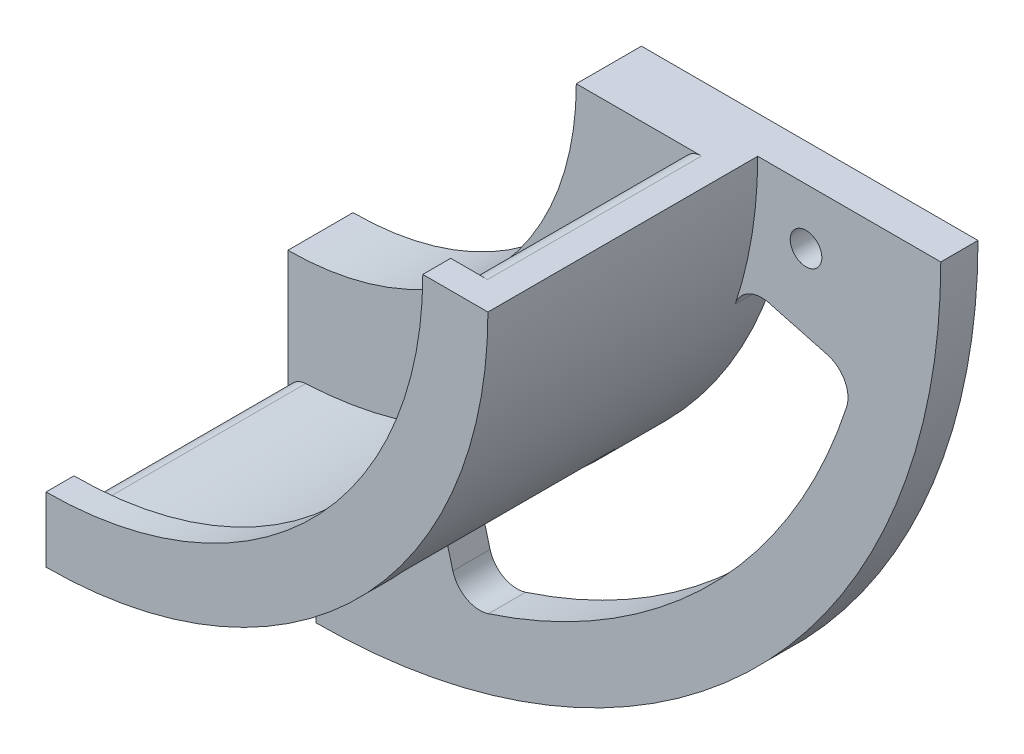
ISO-10303-21;
HEADER;
FILE_DESCRIPTION(('STEP AP214'),'2;1');
FILE_NAME('part.step','',(''),(''),'','','');
FILE_SCHEMA(('AUTOMOTIVE_DESIGN { 1 0 10303 214 1 1 1 1 }'));
ENDSEC;
DATA;
#1=APPLICATION_CONTEXT('core data for automotive mechanical design processes');
#2=APPLICATION_PROTOCOL_DEFINITION('international standard','automotive_design',2000,#1);
#3=PRODUCT_CONTEXT('',#1,'mechanical');
#4=PRODUCT('Part','Part','',(#3));
#5=PRODUCT_RELATED_PRODUCT_CATEGORY('part','',(#4));
#6=PRODUCT_DEFINITION_FORMATION('','',#4);
#7=PRODUCT_DEFINITION_CONTEXT('part definition',#1,'design');
#8=PRODUCT_DEFINITION('design','',#6,#7);
#9=PRODUCT_DEFINITION_SHAPE('','',#8);
#10=(LENGTH_UNIT() NAMED_UNIT(*) SI_UNIT(.MILLI.,.METRE.));
#11=(NAMED_UNIT(*) PLANE_ANGLE_UNIT() SI_UNIT($,.RADIAN.));
#12=(NAMED_UNIT(*) SI_UNIT($,.STERADIAN.) SOLID_ANGLE_UNIT());
#13=UNCERTAINTY_MEASURE_WITH_UNIT(LENGTH_MEASURE(1.E-05),#10,'distance_accuracy_value','');
#14=(GEOMETRIC_REPRESENTATION_CONTEXT(3) GLOBAL_UNCERTAINTY_ASSIGNED_CONTEXT((#13)) GLOBAL_UNIT_ASSIGNED_CONTEXT((#10,
#11,#12)) REPRESENTATION_CONTEXT('',''));
#15=CARTESIAN_POINT('',(0.,0.,0.));
#16=DIRECTION('',(0.,0.,1.));
#17=DIRECTION('',(1.,0.,0.));
#18=AXIS2_PLACEMENT_3D('',#15,#16,#17);
#19=CARTESIAN_POINT('',(-16.6800009459903,-6.49744222896134,3.));
#20=DIRECTION('',(0.,0.,1.));
#21=DIRECTION('',(1.,0.,0.));
#22=AXIS2_PLACEMENT_3D('',#19,#20,#21);
#23=PLANE('',#22);
#24=DIRECTION('',(0.,-1.,0.));
#25=VECTOR('',#24,1.);
#26=CARTESIAN_POINT('',(-16.6800009459903,-37.4974422289613,3.));
#27=LINE('',#26,#25);
#28=CARTESIAN_POINT('',(-16.6800009459903,-37.4974422289613,3.));
#29=VERTEX_POINT('',#28);
#30=CARTESIAN_POINT('',(-16.6800009459903,-50.9524756897518,3.));
#31=VERTEX_POINT('',#30);
#32=EDGE_CURVE('E303',#29,#31,#27,.T.);
#33=ORIENTED_EDGE('',*,*,#32,.T.);
#34=CARTESIAN_POINT('',(-14.6800009459903,-50.9524756897518,3.));
#35=DIRECTION('',(0.,0.,1.));
#36=DIRECTION('',(1.,0.,0.));
#37=AXIS2_PLACEMENT_3D('',#34,#35,#36);
#38=CIRCLE('',#37,2.);
#39=CARTESIAN_POINT('',(-14.7698885864398,-48.9544966578062,3.));
#40=VERTEX_POINT('',#39);
#41=EDGE_CURVE('E339',#31,#40,#38,.F.);
#42=ORIENTED_EDGE('',*,*,#41,.T.);
#43=CARTESIAN_POINT('',(-16.6800009459903,-6.49744222896134,3.));
#44=DIRECTION('',(0.,0.,-1.));
#45=DIRECTION('',(1.,0.,0.));
#46=AXIS2_PLACEMENT_3D('',#43,#44,#45);
#47=CIRCLE('',#46,42.5);
#48=CARTESIAN_POINT('',(10.1790164632336,-39.4343999483835,3.));
#49=VERTEX_POINT('',#48);
#50=EDGE_CURVE('E269',#49,#40,#47,.T.);
#51=ORIENTED_EDGE('',*,*,#50,.F.);
#52=CARTESIAN_POINT('',(11.4429702236677,-40.9843744292975,3.));
#53=DIRECTION('',(0.,0.,1.));
#54=DIRECTION('',(1.,0.,0.));
#55=AXIS2_PLACEMENT_3D('',#52,#53,#54);
#56=CIRCLE('',#55,2.);
#57=CARTESIAN_POINT('',(12.8571837860408,-39.5701608669244,3.));
#58=VERTEX_POINT('',#57);
#59=EDGE_CURVE('E344',#49,#58,#56,.F.);
#60=ORIENTED_EDGE('',*,*,#59,.T.);
#61=DIRECTION('',(-0.707106781186556,0.707106781186539,0.));
#62=VECTOR('',#61,1.);
#63=CARTESIAN_POINT('',(11.5522321010437,-38.2652091819274,3.));
#64=LINE('',#63,#62);
#65=CARTESIAN_POINT('',(15.0932517635406,-41.8062288444242,3.));
#66=VERTEX_POINT('',#65);
#67=EDGE_CURVE('E274',#66,#58,#64,.T.);
#68=ORIENTED_EDGE('',*,*,#67,.F.);
#69=CARTESIAN_POINT('',(-16.6800009459903,-6.49744222896134,3.));
#70=DIRECTION('',(0.,0.,1.));
#71=DIRECTION('',(1.,0.,0.));
#72=AXIS2_PLACEMENT_3D('',#69,#70,#71);
#73=CIRCLE('',#72,47.5);
#74=CARTESIAN_POINT('',(18.6287856694733,-38.2706949384914,3.));
#75=VERTEX_POINT('',#74);
#76=EDGE_CURVE('E296',#66,#75,#73,.T.);
#77=ORIENTED_EDGE('',*,*,#76,.T.);
#78=DIRECTION('',(0.707106781186557,-0.707106781186538,0.));
#79=VECTOR('',#78,1.);
#80=CARTESIAN_POINT('',(15.0877660069764,-34.7296752759946,3.));
#81=LINE('',#80,#79);
#82=CARTESIAN_POINT('',(16.3927176919735,-36.0346269609916,3.));
#83=VERTEX_POINT('',#82);
#84=EDGE_CURVE('E288',#83,#75,#81,.T.);
#85=ORIENTED_EDGE('',*,*,#84,.F.);
#86=CARTESIAN_POINT('',(17.8069312543466,-34.6204133986185,3.));
#87=DIRECTION('',(0.,0.,1.));
#88=DIRECTION('',(1.,0.,0.));
#89=AXIS2_PLACEMENT_3D('',#86,#87,#88);
#90=CIRCLE('',#89,2.);
#91=CARTESIAN_POINT('',(16.2569567734325,-33.3564596381845,3.));
#92=VERTEX_POINT('',#91);
#93=EDGE_CURVE('E348',#83,#92,#90,.F.);
#94=ORIENTED_EDGE('',*,*,#93,.T.);
#95=CARTESIAN_POINT('',(-16.6800009459903,-6.49744222896134,3.));
#96=DIRECTION('',(0.,0.,-1.));
#97=DIRECTION('',(1.,0.,0.));
#98=AXIS2_PLACEMENT_3D('',#95,#96,#97);
#99=CIRCLE('',#98,42.5);
#100=CARTESIAN_POINT('',(25.7770534828545,-8.4075545885119,3.));
#101=VERTEX_POINT('',#100);
#102=EDGE_CURVE('E283',#101,#92,#99,.T.);
#103=ORIENTED_EDGE('',*,*,#102,.F.);
#104=CARTESIAN_POINT('',(27.7750325148001,-8.49744222896134,3.));
#105=DIRECTION('',(0.,0.,1.));
#106=DIRECTION('',(1.,0.,0.));
#107=AXIS2_PLACEMENT_3D('',#104,#105,#106);
#108=CIRCLE('',#107,2.);
#109=CARTESIAN_POINT('',(27.7750325148001,-6.49744222896134,3.));
#110=VERTEX_POINT('',#109);
#111=EDGE_CURVE('E334',#101,#110,#108,.F.);
#112=ORIENTED_EDGE('',*,*,#111,.T.);
#113=DIRECTION('',(-1.,0.,0.));
#114=VECTOR('',#113,1.);
#115=CARTESIAN_POINT('',(14.3199990540097,-6.49744222896134,3.));
#116=LINE('',#115,#114);
#117=CARTESIAN_POINT('',(14.3199990540097,-6.49744222896134,3.));
#118=VERTEX_POINT('',#117);
#119=EDGE_CURVE('E299',#110,#118,#116,.T.);
#120=ORIENTED_EDGE('',*,*,#119,.T.);
#121=CARTESIAN_POINT('',(-16.6800009459903,-6.49744222896134,3.));
#122=DIRECTION('',(0.,0.,-1.));
#123=DIRECTION('',(1.,0.,0.));
#124=AXIS2_PLACEMENT_3D('',#121,#122,#123);
#125=CIRCLE('',#124,31.);
#126=EDGE_CURVE('E301',#118,#29,#125,.T.);
#127=ORIENTED_EDGE('',*,*,#126,.T.);
#128=EDGE_LOOP('',(#33,#42,#51,#60,#68,#77,#85,#94,#103,#112,#120,#127));
#129=FACE_BOUND('',#128,.T.);
#130=ADVANCED_FACE('F35',(#129),#23,.T.);
#131=CARTESIAN_POINT('',(-16.6800009459903,-6.49744222896134,3.));
#132=DIRECTION('',(0.,0.,-1.));
#133=DIRECTION('',(-1.,0.,0.));
#134=AXIS2_PLACEMENT_3D('',#131,#132,#133);
#135=CYLINDRICAL_SURFACE('',#134,47.5);
#136=CARTESIAN_POINT('',(-16.6800009459903,-6.49744222896134,0.));
#137=DIRECTION('',(0.,0.,1.));
#138=DIRECTION('',(1.,0.,0.));
#139=AXIS2_PLACEMENT_3D('',#136,#137,#138);
#140=CIRCLE('',#139,47.5);
#141=CARTESIAN_POINT('',(-16.6800009459905,-53.9974422289613,0.));
#142=VERTEX_POINT('',#141);
#143=CARTESIAN_POINT('',(-1.68217619344417,-51.5675570800677,0.));
#144=VERTEX_POINT('',#143);
#145=EDGE_CURVE('E50',#142,#144,#140,.T.);
#146=ORIENTED_EDGE('',*,*,#145,.T.);
#147=DIRECTION('',(0.,0.,-1.));
#148=VECTOR('',#147,1.);
#149=CARTESIAN_POINT('',(-1.68217619344417,-51.5675570800677,3.));
#150=LINE('',#149,#148);
#151=CARTESIAN_POINT('',(-1.68217619344416,-51.5675570800677,-4.));
#152=VERTEX_POINT('',#151);
#153=EDGE_CURVE('E370',#144,#152,#150,.T.);
#154=ORIENTED_EDGE('',*,*,#153,.T.);
#155=CARTESIAN_POINT('',(-16.6800009459903,-6.49744222896134,-4.));
#156=DIRECTION('',(0.,0.,1.));
#157=DIRECTION('',(-1.,0.,0.));
#158=AXIS2_PLACEMENT_3D('',#155,#156,#157);
#159=CIRCLE('',#158,47.5);
#160=CARTESIAN_POINT('',(28.3901139051159,-21.4952669815078,-4.));
#161=VERTEX_POINT('',#160);
#162=EDGE_CURVE('E403',#152,#161,#159,.T.);
#163=ORIENTED_EDGE('',*,*,#162,.T.);
#164=DIRECTION('',(0.,0.,-1.));
#165=VECTOR('',#164,1.);
#166=CARTESIAN_POINT('',(28.3901139051159,-21.4952669815078,3.));
#167=LINE('',#166,#165);
#168=CARTESIAN_POINT('',(28.3901139051159,-21.4952669815078,0.));
#169=VERTEX_POINT('',#168);
#170=EDGE_CURVE('E367',#161,#169,#167,.F.);
#171=ORIENTED_EDGE('',*,*,#170,.T.);
#172=CARTESIAN_POINT('',(30.8199990540097,-6.49744222896134,0.));
#173=VERTEX_POINT('',#172);
#174=EDGE_CURVE('E58',#169,#173,#140,.T.);
#175=ORIENTED_EDGE('',*,*,#174,.T.);
#176=DIRECTION('',(0.,0.,-1.));
#177=VECTOR('',#176,1.);
#178=CARTESIAN_POINT('',(30.8199990540097,-6.49744222896134,3.));
#179=LINE('',#178,#177);
#180=CARTESIAN_POINT('',(30.8199990540097,-6.49744222896134,29.));
#181=VERTEX_POINT('',#180);
#182=EDGE_CURVE('E311',#181,#173,#179,.T.);
#183=ORIENTED_EDGE('',*,*,#182,.F.);
#184=CARTESIAN_POINT('',(-16.6800009459903,-6.49744222896134,29.));
#185=DIRECTION('',(0.,0.,1.));
#186=DIRECTION('',(1.,0.,0.));
#187=AXIS2_PLACEMENT_3D('',#184,#185,#186);
#188=CIRCLE('',#187,47.5);
#189=CARTESIAN_POINT('',(-16.6800009459903,-53.9974422289613,29.));
#190=VERTEX_POINT('',#189);
#191=EDGE_CURVE('E253',#190,#181,#188,.T.);
#192=ORIENTED_EDGE('',*,*,#191,.F.);
#193=DIRECTION('',(0.,0.,-1.));
#194=VECTOR('',#193,1.);
#195=CARTESIAN_POINT('',(-16.6800009459903,-53.9974422289613,3.));
#196=LINE('',#195,#194);
#197=EDGE_CURVE('E305',#190,#142,#196,.T.);
#198=ORIENTED_EDGE('',*,*,#197,.T.);
#199=EDGE_LOOP('',(#146,#154,#163,#171,#175,#183,#192,#198));
#200=FACE_BOUND('',#199,.T.);
#201=CARTESIAN_POINT('',(-16.6800009459903,-6.49744222896134,26.));
#202=DIRECTION('',(0.,0.,1.));
#203=DIRECTION('',(1.,0.,0.));
#204=AXIS2_PLACEMENT_3D('',#201,#202,#203);
#205=CIRCLE('',#204,47.5);
#206=CARTESIAN_POINT('',(15.0932517635406,-41.8062288444242,26.));
#207=VERTEX_POINT('',#206);
#208=CARTESIAN_POINT('',(18.6287856694733,-38.2706949384914,26.));
#209=VERTEX_POINT('',#208);
#210=EDGE_CURVE('E260',#207,#209,#205,.T.);
#211=ORIENTED_EDGE('',*,*,#210,.T.);
#212=DIRECTION('',(0.,0.,-1.));
#213=VECTOR('',#212,1.);
#214=CARTESIAN_POINT('',(18.6287856694733,-38.2706949384914,26.));
#215=LINE('',#214,#213);
#216=EDGE_CURVE('E290',#209,#75,#215,.T.);
#217=ORIENTED_EDGE('',*,*,#216,.T.);
#218=ORIENTED_EDGE('',*,*,#76,.F.);
#219=DIRECTION('',(0.,0.,-1.));
#220=VECTOR('',#219,1.);
#221=CARTESIAN_POINT('',(15.0932517635406,-41.8062288444242,26.));
#222=LINE('',#221,#220);
#223=EDGE_CURVE('E277',#207,#66,#222,.T.);
#224=ORIENTED_EDGE('',*,*,#223,.F.);
#225=EDGE_LOOP('',(#211,#217,#218,#224));
#226=FACE_BOUND('',#225,.T.);
#227=ADVANCED_FACE('F406',(#200,#226),#135,.T.);
#228=CARTESIAN_POINT('',(14.3199990540097,-6.49744222896134,3.));
#229=DIRECTION('',(0.,-1.,0.));
#230=DIRECTION('',(0.,0.,-1.));
#231=AXIS2_PLACEMENT_3D('',#228,#229,#230);
#232=PLANE('',#231);
#233=ORIENTED_EDGE('',*,*,#119,.F.);
#234=DIRECTION('',(0.,0.,-1.));
#235=VECTOR('',#234,1.);
#236=CARTESIAN_POINT('',(27.7750325148001,-6.49744222896134,3.));
#237=LINE('',#236,#235);
#238=CARTESIAN_POINT('',(27.7750325148001,-6.49744222896134,26.));
#239=VERTEX_POINT('',#238);
#240=EDGE_CURVE('E319',#110,#239,#237,.F.);
#241=ORIENTED_EDGE('',*,*,#240,.T.);
#242=DIRECTION('',(-1.,0.,0.));
#243=VECTOR('',#242,1.);
#244=CARTESIAN_POINT('',(23.8199990540097,-6.49744222896134,26.));
#245=LINE('',#244,#243);
#246=CARTESIAN_POINT('',(23.8199990540097,-6.49744222896134,26.));
#247=VERTEX_POINT('',#246);
#248=EDGE_CURVE('E250',#239,#247,#245,.T.);
#249=ORIENTED_EDGE('',*,*,#248,.T.);
#250=DIRECTION('',(0.,0.,-1.));
#251=VECTOR('',#250,1.);
#252=CARTESIAN_POINT('',(23.8199990540097,-6.49744222896134,29.));
#253=LINE('',#252,#251);
#254=CARTESIAN_POINT('',(23.8199990540097,-6.49744222896134,29.));
#255=VERTEX_POINT('',#254);
#256=EDGE_CURVE('E257',#255,#247,#253,.T.);
#257=ORIENTED_EDGE('',*,*,#256,.F.);
#258=DIRECTION('',(-1.,0.,0.));
#259=VECTOR('',#258,1.);
#260=CARTESIAN_POINT('',(23.8199990540097,-6.49744222896134,29.));
#261=LINE('',#260,#259);
#262=EDGE_CURVE('E256',#181,#255,#261,.T.);
#263=ORIENTED_EDGE('',*,*,#262,.F.);
#264=ORIENTED_EDGE('',*,*,#182,.T.);
#265=DIRECTION('',(1.,0.,0.));
#266=VECTOR('',#265,1.);
#267=CARTESIAN_POINT('',(50.4951432667317,-6.49744222896134,0.));
#268=LINE('',#267,#266);
#269=CARTESIAN_POINT('',(50.4951432667317,-6.49744222896134,0.));
#270=VERTEX_POINT('',#269);
#271=EDGE_CURVE('E232',#173,#270,#268,.T.);
#272=ORIENTED_EDGE('',*,*,#271,.T.);
#273=DIRECTION('',(0.,0.,1.));
#274=VECTOR('',#273,1.);
#275=CARTESIAN_POINT('',(50.4951432667317,-6.49744222896134,-4.));
#276=LINE('',#275,#274);
#277=CARTESIAN_POINT('',(50.4951432667317,-6.49744222896134,-4.));
#278=VERTEX_POINT('',#277);
#279=EDGE_CURVE('E238',#278,#270,#276,.T.);
#280=ORIENTED_EDGE('',*,*,#279,.F.);
#281=DIRECTION('',(1.,0.,0.));
#282=VECTOR('',#281,1.);
#283=CARTESIAN_POINT('',(50.4951432667317,-6.49744222896134,-4.));
#284=LINE('',#283,#282);
#285=CARTESIAN_POINT('',(14.3199990540097,-6.49744222896134,-4.));
#286=VERTEX_POINT('',#285);
#287=EDGE_CURVE('E228',#286,#278,#284,.T.);
#288=ORIENTED_EDGE('',*,*,#287,.F.);
#289=DIRECTION('',(0.,0.,-1.));
#290=VECTOR('',#289,1.);
#291=CARTESIAN_POINT('',(14.3199990540097,-6.49744222896134,3.));
#292=LINE('',#291,#290);
#293=EDGE_CURVE('E309',#118,#286,#292,.T.);
#294=ORIENTED_EDGE('',*,*,#293,.F.);
#295=EDGE_LOOP('',(#233,#241,#249,#257,#263,#264,#272,#280,#288,#294));
#296=FACE_BOUND('',#295,.T.);
#297=ADVANCED_FACE('F431',(#296),#232,.F.);
#298=CARTESIAN_POINT('',(-16.6800009459903,-6.49744222896134,3.));
#299=DIRECTION('',(0.,0.,-1.));
#300=DIRECTION('',(-1.,0.,0.));
#301=AXIS2_PLACEMENT_3D('',#298,#299,#300);
#302=CYLINDRICAL_SURFACE('',#301,31.);
#303=ORIENTED_EDGE('',*,*,#293,.T.);
#304=CARTESIAN_POINT('',(-16.6800009459903,-6.49744222896134,-4.));
#305=DIRECTION('',(0.,0.,1.));
#306=DIRECTION('',(-1.,0.,0.));
#307=AXIS2_PLACEMENT_3D('',#304,#305,#306);
#308=CIRCLE('',#307,31.);
#309=CARTESIAN_POINT('',(-16.6800009459905,-37.4974422289613,-4.));
#310=VERTEX_POINT('',#309);
#311=EDGE_CURVE('E221',#310,#286,#308,.T.);
#312=ORIENTED_EDGE('',*,*,#311,.F.);
#313=DIRECTION('',(0.,0.,-1.));
#314=VECTOR('',#313,1.);
#315=CARTESIAN_POINT('',(-16.6800009459903,-37.4974422289613,3.));
#316=LINE('',#315,#314);
#317=EDGE_CURVE('E217',#29,#310,#316,.T.);
#318=ORIENTED_EDGE('',*,*,#317,.F.);
#319=ORIENTED_EDGE('',*,*,#126,.F.);
#320=EDGE_LOOP('',(#303,#312,#318,#319));
#321=FACE_BOUND('',#320,.T.);
#322=ADVANCED_FACE('F502',(#321),#302,.F.);
#323=CARTESIAN_POINT('',(-16.6800009459903,-37.4974422289613,3.));
#324=DIRECTION('',(1.,0.,0.));
#325=DIRECTION('',(0.,0.,-1.));
#326=AXIS2_PLACEMENT_3D('',#323,#324,#325);
#327=PLANE('',#326);
#328=DIRECTION('',(0.,0.,-1.));
#329=VECTOR('',#328,1.);
#330=CARTESIAN_POINT('',(-16.6800009459903,-50.9524756897518,3.));
#331=LINE('',#330,#329);
#332=CARTESIAN_POINT('',(-16.6800009459903,-50.9524756897518,26.));
#333=VERTEX_POINT('',#332);
#334=EDGE_CURVE('E322',#333,#31,#331,.T.);
#335=ORIENTED_EDGE('',*,*,#334,.T.);
#336=ORIENTED_EDGE('',*,*,#32,.F.);
#337=ORIENTED_EDGE('',*,*,#317,.T.);
#338=DIRECTION('',(0.,1.,0.));
#339=VECTOR('',#338,1.);
#340=CARTESIAN_POINT('',(-16.6800009459906,-73.6725864416837,-4.));
#341=LINE('',#340,#339);
#342=CARTESIAN_POINT('',(-16.6800009459906,-73.6725864416837,-4.));
#343=VERTEX_POINT('',#342);
#344=EDGE_CURVE('E207',#343,#310,#341,.T.);
#345=ORIENTED_EDGE('',*,*,#344,.F.);
#346=DIRECTION('',(0.,0.,1.));
#347=VECTOR('',#346,1.);
#348=CARTESIAN_POINT('',(-16.6800009459906,-73.6725864416837,-4.));
#349=LINE('',#348,#347);
#350=CARTESIAN_POINT('',(-16.6800009459906,-73.6725864416837,0.));
#351=VERTEX_POINT('',#350);
#352=EDGE_CURVE('E213',#343,#351,#349,.T.);
#353=ORIENTED_EDGE('',*,*,#352,.T.);
#354=DIRECTION('',(0.,1.,0.));
#355=VECTOR('',#354,1.);
#356=CARTESIAN_POINT('',(-16.6800009459906,-73.6725864416837,0.));
#357=LINE('',#356,#355);
#358=EDGE_CURVE('E429',#351,#142,#357,.T.);
#359=ORIENTED_EDGE('',*,*,#358,.T.);
#360=ORIENTED_EDGE('',*,*,#197,.F.);
#361=DIRECTION('',(0.,-1.,0.));
#362=VECTOR('',#361,1.);
#363=CARTESIAN_POINT('',(-16.6800009459903,-46.9974422289613,29.));
#364=LINE('',#363,#362);
#365=CARTESIAN_POINT('',(-16.6800009459903,-46.9974422289613,29.));
#366=VERTEX_POINT('',#365);
#367=EDGE_CURVE('E249',#366,#190,#364,.T.);
#368=ORIENTED_EDGE('',*,*,#367,.F.);
#369=DIRECTION('',(0.,0.,-1.));
#370=VECTOR('',#369,1.);
#371=CARTESIAN_POINT('',(-16.6800009459903,-46.9974422289613,29.));
#372=LINE('',#371,#370);
#373=CARTESIAN_POINT('',(-16.6800009459903,-46.9974422289613,26.));
#374=VERTEX_POINT('',#373);
#375=EDGE_CURVE('E266',#366,#374,#372,.T.);
#376=ORIENTED_EDGE('',*,*,#375,.T.);
#377=DIRECTION('',(0.,-1.,0.));
#378=VECTOR('',#377,1.);
#379=CARTESIAN_POINT('',(-16.6800009459903,-46.9974422289613,26.));
#380=LINE('',#379,#378);
#381=EDGE_CURVE('E241',#374,#333,#380,.T.);
#382=ORIENTED_EDGE('',*,*,#381,.T.);
#383=EDGE_LOOP('',(#335,#336,#337,#345,#353,#359,#360,#368,#376,#382));
#384=FACE_BOUND('',#383,.T.);
#385=ADVANCED_FACE('F210',(#384),#327,.F.);
#386=CARTESIAN_POINT('',(-16.6800009459903,-6.49744222896134,26.));
#387=DIRECTION('',(0.,0.,-1.));
#388=DIRECTION('',(-1.,0.,0.));
#389=AXIS2_PLACEMENT_3D('',#386,#387,#388);
#390=CYLINDRICAL_SURFACE('',#389,42.5);
#391=CARTESIAN_POINT('',(-16.6800009459903,-6.49744222896134,26.));
#392=DIRECTION('',(0.,0.,-1.));
#393=DIRECTION('',(1.,0.,0.));
#394=AXIS2_PLACEMENT_3D('',#391,#392,#393);
#395=CIRCLE('',#394,42.5);
#396=CARTESIAN_POINT('',(25.7770534828545,-8.4075545885119,26.));
#397=VERTEX_POINT('',#396);
#398=CARTESIAN_POINT('',(16.2569567734325,-33.3564596381845,26.));
#399=VERTEX_POINT('',#398);
#400=EDGE_CURVE('E284',#397,#399,#395,.T.);
#401=ORIENTED_EDGE('',*,*,#400,.F.);
#402=DIRECTION('',(0.,0.,-1.));
#403=VECTOR('',#402,1.);
#404=CARTESIAN_POINT('',(25.7770534828545,-8.4075545885119,26.));
#405=LINE('',#404,#403);
#406=EDGE_CURVE('E316',#397,#101,#405,.T.);
#407=ORIENTED_EDGE('',*,*,#406,.T.);
#408=ORIENTED_EDGE('',*,*,#102,.T.);
#409=DIRECTION('',(0.,0.,-1.));
#410=VECTOR('',#409,1.);
#411=CARTESIAN_POINT('',(16.2569567734325,-33.3564596381845,26.));
#412=LINE('',#411,#410);
#413=EDGE_CURVE('E314',#92,#399,#412,.F.);
#414=ORIENTED_EDGE('',*,*,#413,.T.);
#415=EDGE_LOOP('',(#401,#407,#408,#414));
#416=FACE_BOUND('',#415,.T.);
#417=ADVANCED_FACE('F478',(#416),#390,.F.);
#418=CARTESIAN_POINT('',(15.0877660069764,-34.7296752759946,26.));
#419=DIRECTION('',(0.707106781186538,0.707106781186557,0.));
#420=DIRECTION('',(-0.707106781186557,0.707106781186538,0.));
#421=AXIS2_PLACEMENT_3D('',#418,#419,#420);
#422=PLANE('',#421);
#423=DIRECTION('',(0.707106781186557,-0.707106781186538,0.));
#424=VECTOR('',#423,1.);
#425=CARTESIAN_POINT('',(15.0877660069764,-34.7296752759946,26.));
#426=LINE('',#425,#424);
#427=CARTESIAN_POINT('',(16.3927176919735,-36.0346269609916,26.));
#428=VERTEX_POINT('',#427);
#429=EDGE_CURVE('E287',#428,#209,#426,.T.);
#430=ORIENTED_EDGE('',*,*,#429,.F.);
#431=DIRECTION('',(0.,0.,-1.));
#432=VECTOR('',#431,1.);
#433=CARTESIAN_POINT('',(16.3927176919735,-36.0346269609916,26.));
#434=LINE('',#433,#432);
#435=EDGE_CURVE('E331',#428,#83,#434,.T.);
#436=ORIENTED_EDGE('',*,*,#435,.T.);
#437=ORIENTED_EDGE('',*,*,#84,.T.);
#438=ORIENTED_EDGE('',*,*,#216,.F.);
#439=EDGE_LOOP('',(#430,#436,#437,#438));
#440=FACE_BOUND('',#439,.T.);
#441=ADVANCED_FACE('F471',(#440),#422,.F.);
#442=CARTESIAN_POINT('',(-16.6800009459903,-6.49744222896134,26.));
#443=DIRECTION('',(0.,0.,-1.));
#444=DIRECTION('',(-1.,0.,0.));
#445=AXIS2_PLACEMENT_3D('',#442,#443,#444);
#446=CYLINDRICAL_SURFACE('',#445,42.5);
#447=ORIENTED_EDGE('',*,*,#50,.T.);
#448=DIRECTION('',(0.,0.,-1.));
#449=VECTOR('',#448,1.);
#450=CARTESIAN_POINT('',(-14.7698885864398,-48.9544966578062,26.));
#451=LINE('',#450,#449);
#452=CARTESIAN_POINT('',(-14.7698885864398,-48.9544966578062,26.));
#453=VERTEX_POINT('',#452);
#454=EDGE_CURVE('E327',#40,#453,#451,.F.);
#455=ORIENTED_EDGE('',*,*,#454,.T.);
#456=CARTESIAN_POINT('',(-16.6800009459903,-6.49744222896134,26.));
#457=DIRECTION('',(0.,0.,-1.));
#458=DIRECTION('',(1.,0.,0.));
#459=AXIS2_PLACEMENT_3D('',#456,#457,#458);
#460=CIRCLE('',#459,42.5);
#461=CARTESIAN_POINT('',(10.1790164632336,-39.4343999483835,26.));
#462=VERTEX_POINT('',#461);
#463=EDGE_CURVE('E270',#462,#453,#460,.T.);
#464=ORIENTED_EDGE('',*,*,#463,.F.);
#465=DIRECTION('',(0.,0.,-1.));
#466=VECTOR('',#465,1.);
#467=CARTESIAN_POINT('',(10.1790164632337,-39.4343999483835,26.));
#468=LINE('',#467,#466);
#469=EDGE_CURVE('E324',#462,#49,#468,.T.);
#470=ORIENTED_EDGE('',*,*,#469,.T.);
#471=EDGE_LOOP('',(#447,#455,#464,#470));
#472=FACE_BOUND('',#471,.T.);
#473=ADVANCED_FACE('F454',(#472),#446,.F.);
#474=CARTESIAN_POINT('',(11.5522321010437,-38.2652091819274,26.));
#475=DIRECTION('',(-0.707106781186539,-0.707106781186556,0.));
#476=DIRECTION('',(0.707106781186556,-0.707106781186539,0.));
#477=AXIS2_PLACEMENT_3D('',#474,#475,#476);
#478=PLANE('',#477);
#479=ORIENTED_EDGE('',*,*,#67,.T.);
#480=DIRECTION('',(0.,0.,-1.));
#481=VECTOR('',#480,1.);
#482=CARTESIAN_POINT('',(12.8571837860408,-39.5701608669244,26.));
#483=LINE('',#482,#481);
#484=CARTESIAN_POINT('',(12.8571837860408,-39.5701608669244,26.));
#485=VERTEX_POINT('',#484);
#486=EDGE_CURVE('E329',#58,#485,#483,.F.);
#487=ORIENTED_EDGE('',*,*,#486,.T.);
#488=DIRECTION('',(-0.707106781186556,0.707106781186539,0.));
#489=VECTOR('',#488,1.);
#490=CARTESIAN_POINT('',(11.5522321010437,-38.2652091819274,26.));
#491=LINE('',#490,#489);
#492=EDGE_CURVE('E273',#207,#485,#491,.T.);
#493=ORIENTED_EDGE('',*,*,#492,.F.);
#494=ORIENTED_EDGE('',*,*,#223,.T.);
#495=EDGE_LOOP('',(#479,#487,#493,#494));
#496=FACE_BOUND('',#495,.T.);
#497=ADVANCED_FACE('F463',(#496),#478,.F.);
#498=CARTESIAN_POINT('',(-16.6800009459903,-6.49744222896134,26.));
#499=DIRECTION('',(0.,0.,1.));
#500=DIRECTION('',(1.,0.,0.));
#501=AXIS2_PLACEMENT_3D('',#498,#499,#500);
#502=PLANE('',#501);
#503=ORIENTED_EDGE('',*,*,#248,.F.);
#504=CARTESIAN_POINT('',(27.7750325148001,-8.49744222896134,26.));
#505=DIRECTION('',(0.,0.,1.));
#506=DIRECTION('',(1.,0.,0.));
#507=AXIS2_PLACEMENT_3D('',#504,#505,#506);
#508=CIRCLE('',#507,2.);
#509=EDGE_CURVE('E337',#239,#397,#508,.T.);
#510=ORIENTED_EDGE('',*,*,#509,.T.);
#511=ORIENTED_EDGE('',*,*,#400,.T.);
#512=CARTESIAN_POINT('',(17.8069312543466,-34.6204133986185,26.));
#513=DIRECTION('',(0.,0.,1.));
#514=DIRECTION('',(1.,0.,0.));
#515=AXIS2_PLACEMENT_3D('',#512,#513,#514);
#516=CIRCLE('',#515,2.);
#517=EDGE_CURVE('E350',#399,#428,#516,.T.);
#518=ORIENTED_EDGE('',*,*,#517,.T.);
#519=ORIENTED_EDGE('',*,*,#429,.T.);
#520=ORIENTED_EDGE('',*,*,#210,.F.);
#521=ORIENTED_EDGE('',*,*,#492,.T.);
#522=CARTESIAN_POINT('',(11.4429702236677,-40.9843744292975,26.));
#523=DIRECTION('',(0.,0.,1.));
#524=DIRECTION('',(1.,0.,0.));
#525=AXIS2_PLACEMENT_3D('',#522,#523,#524);
#526=CIRCLE('',#525,2.);
#527=EDGE_CURVE('E346',#485,#462,#526,.T.);
#528=ORIENTED_EDGE('',*,*,#527,.T.);
#529=ORIENTED_EDGE('',*,*,#463,.T.);
#530=CARTESIAN_POINT('',(-14.6800009459903,-50.9524756897518,26.));
#531=DIRECTION('',(0.,0.,1.));
#532=DIRECTION('',(1.,0.,0.));
#533=AXIS2_PLACEMENT_3D('',#530,#531,#532);
#534=CIRCLE('',#533,2.);
#535=EDGE_CURVE('E341',#453,#333,#534,.T.);
#536=ORIENTED_EDGE('',*,*,#535,.T.);
#537=ORIENTED_EDGE('',*,*,#381,.F.);
#538=CARTESIAN_POINT('',(-16.6800009459903,-6.49744222896134,26.));
#539=DIRECTION('',(0.,0.,-1.));
#540=DIRECTION('',(1.,0.,0.));
#541=AXIS2_PLACEMENT_3D('',#538,#539,#540);
#542=CIRCLE('',#541,40.5);
#543=EDGE_CURVE('E237',#247,#374,#542,.T.);
#544=ORIENTED_EDGE('',*,*,#543,.F.);
#545=EDGE_LOOP('',(#503,#510,#511,#518,#519,#520,#521,#528,#529,#536,#537,#544));
#546=FACE_BOUND('',#545,.T.);
#547=ADVANCED_FACE('F445',(#546),#502,.F.);
#548=CARTESIAN_POINT('',(-16.6800009459903,-6.49744222896134,29.));
#549=DIRECTION('',(0.,0.,-1.));
#550=DIRECTION('',(-1.,0.,0.));
#551=AXIS2_PLACEMENT_3D('',#548,#549,#550);
#552=CYLINDRICAL_SURFACE('',#551,40.5);
#553=ORIENTED_EDGE('',*,*,#543,.T.);
#554=ORIENTED_EDGE('',*,*,#375,.F.);
#555=CARTESIAN_POINT('',(-16.6800009459903,-6.49744222896134,29.));
#556=DIRECTION('',(0.,0.,-1.));
#557=DIRECTION('',(1.,0.,0.));
#558=AXIS2_PLACEMENT_3D('',#555,#556,#557);
#559=CIRCLE('',#558,40.5);
#560=EDGE_CURVE('E246',#255,#366,#559,.T.);
#561=ORIENTED_EDGE('',*,*,#560,.F.);
#562=ORIENTED_EDGE('',*,*,#256,.T.);
#563=EDGE_LOOP('',(#553,#554,#561,#562));
#564=FACE_BOUND('',#563,.T.);
#565=ADVANCED_FACE('F441',(#564),#552,.F.);
#566=CARTESIAN_POINT('',(-16.6800009459903,-6.49744222896134,29.));
#567=DIRECTION('',(0.,0.,1.));
#568=DIRECTION('',(1.,0.,0.));
#569=AXIS2_PLACEMENT_3D('',#566,#567,#568);
#570=PLANE('',#569);
#571=ORIENTED_EDGE('',*,*,#560,.T.);
#572=ORIENTED_EDGE('',*,*,#367,.T.);
#573=ORIENTED_EDGE('',*,*,#191,.T.);
#574=ORIENTED_EDGE('',*,*,#262,.T.);
#575=EDGE_LOOP('',(#571,#572,#573,#574));
#576=FACE_BOUND('',#575,.T.);
#577=ADVANCED_FACE('F435',(#576),#570,.T.);
#578=CARTESIAN_POINT('',(27.7750325148001,-8.49744222896134,26.));
#579=DIRECTION('',(0.,0.,-1.));
#580=DIRECTION('',(-1.,0.,0.));
#581=AXIS2_PLACEMENT_3D('',#578,#579,#580);
#582=CYLINDRICAL_SURFACE('',#581,2.);
#583=ORIENTED_EDGE('',*,*,#509,.F.);
#584=ORIENTED_EDGE('',*,*,#240,.F.);
#585=ORIENTED_EDGE('',*,*,#111,.F.);
#586=ORIENTED_EDGE('',*,*,#406,.F.);
#587=EDGE_LOOP('',(#583,#584,#585,#586));
#588=FACE_BOUND('',#587,.T.);
#589=ADVANCED_FACE('F508',(#588),#582,.T.);
#590=CARTESIAN_POINT('',(-14.6800009459903,-50.9524756897518,26.));
#591=DIRECTION('',(0.,0.,-1.));
#592=DIRECTION('',(-1.,0.,0.));
#593=AXIS2_PLACEMENT_3D('',#590,#591,#592);
#594=CYLINDRICAL_SURFACE('',#593,2.);
#595=ORIENTED_EDGE('',*,*,#535,.F.);
#596=ORIENTED_EDGE('',*,*,#454,.F.);
#597=ORIENTED_EDGE('',*,*,#41,.F.);
#598=ORIENTED_EDGE('',*,*,#334,.F.);
#599=EDGE_LOOP('',(#595,#596,#597,#598));
#600=FACE_BOUND('',#599,.T.);
#601=ADVANCED_FACE('F450',(#600),#594,.T.);
#602=CARTESIAN_POINT('',(11.4429702236677,-40.9843744292975,26.));
#603=DIRECTION('',(0.,0.,-1.));
#604=DIRECTION('',(-1.,0.,0.));
#605=AXIS2_PLACEMENT_3D('',#602,#603,#604);
#606=CYLINDRICAL_SURFACE('',#605,2.);
#607=ORIENTED_EDGE('',*,*,#527,.F.);
#608=ORIENTED_EDGE('',*,*,#486,.F.);
#609=ORIENTED_EDGE('',*,*,#59,.F.);
#610=ORIENTED_EDGE('',*,*,#469,.F.);
#611=EDGE_LOOP('',(#607,#608,#609,#610));
#612=FACE_BOUND('',#611,.T.);
#613=ADVANCED_FACE('F458',(#612),#606,.T.);
#614=CARTESIAN_POINT('',(17.8069312543466,-34.6204133986185,26.));
#615=DIRECTION('',(0.,0.,-1.));
#616=DIRECTION('',(-1.,0.,0.));
#617=AXIS2_PLACEMENT_3D('',#614,#615,#616);
#618=CYLINDRICAL_SURFACE('',#617,2.);
#619=ORIENTED_EDGE('',*,*,#517,.F.);
#620=ORIENTED_EDGE('',*,*,#413,.F.);
#621=ORIENTED_EDGE('',*,*,#93,.F.);
#622=ORIENTED_EDGE('',*,*,#435,.F.);
#623=EDGE_LOOP('',(#619,#620,#621,#622));
#624=FACE_BOUND('',#623,.T.);
#625=ADVANCED_FACE('F480',(#624),#618,.T.);
#626=CARTESIAN_POINT('',(-16.6800009459903,-6.49744222896134,-4.));
#627=DIRECTION('',(0.,0.,-1.));
#628=DIRECTION('',(-1.,0.,0.));
#629=AXIS2_PLACEMENT_3D('',#626,#627,#628);
#630=PLANE('',#629);
#631=CARTESIAN_POINT('',(-10.6800009459903,-59.1873050674448,-4.));
#632=DIRECTION('',(0.,0.,-1.));
#633=DIRECTION('',(-1.,0.,0.));
#634=AXIS2_PLACEMENT_3D('',#631,#632,#633);
#635=CIRCLE('',#634,1.7);
#636=CARTESIAN_POINT('',(-12.3800009459903,-59.1873050674448,-4.));
#637=VERTEX_POINT('',#636);
#638=EDGE_CURVE('E397',#637,#637,#635,.T.);
#639=ORIENTED_EDGE('',*,*,#638,.F.);
#640=EDGE_LOOP('',(#639));
#641=FACE_BOUND('',#640,.T.);
#642=CARTESIAN_POINT('',(-16.6800009459903,-6.49744222896134,-4.));
#643=DIRECTION('',(0.,0.,-1.));
#644=DIRECTION('',(-1.,0.,0.));
#645=AXIS2_PLACEMENT_3D('',#642,#643,#644);
#646=CIRCLE('',#645,67.1751442127222);
#647=EDGE_CURVE('E222',#278,#343,#646,.T.);
#648=ORIENTED_EDGE('',*,*,#647,.T.);
#649=ORIENTED_EDGE('',*,*,#344,.T.);
#650=ORIENTED_EDGE('',*,*,#311,.T.);
#651=ORIENTED_EDGE('',*,*,#287,.T.);
#652=EDGE_LOOP('',(#648,#649,#650,#651));
#653=FACE_BOUND('',#652,.T.);
#654=DIRECTION('',(0.965925826289068,-0.258819045102521,0.));
#655=VECTOR('',#654,1.);
#656=CARTESIAN_POINT('',(41.2755486313538,-22.0265849351126,-4.));
#657=LINE('',#656,#655);
#658=CARTESIAN_POINT('',(32.013104609967,-19.5447205396436,-4.));
#659=VERTEX_POINT('',#658);
#660=CARTESIAN_POINT('',(38.3014609673745,-21.22968054733,-4.));
#661=VERTEX_POINT('',#660);
#662=EDGE_CURVE('E405',#659,#661,#657,.T.);
#663=ORIENTED_EDGE('',*,*,#662,.F.);
#664=CARTESIAN_POINT('',(31.2366474746594,-22.4424980185108,-4.));
#665=DIRECTION('',(0.,0.,-1.));
#666=DIRECTION('',(-1.,0.,0.));
#667=AXIS2_PLACEMENT_3D('',#664,#665,#666);
#668=CIRCLE('',#667,3.);
#669=EDGE_CURVE('E11',#659,#161,#668,.F.);
#670=ORIENTED_EDGE('',*,*,#669,.T.);
#671=ORIENTED_EDGE('',*,*,#162,.F.);
#672=CARTESIAN_POINT('',(-0.734945156441257,-54.4140906496112,-4.));
#673=DIRECTION('',(0.,0.,-1.));
#674=DIRECTION('',(-1.,0.,0.));
#675=AXIS2_PLACEMENT_3D('',#672,#673,#674);
#676=CIRCLE('',#675,3.);
#677=CARTESIAN_POINT('',(-3.63272263530847,-55.1905477849188,-4.));
#678=VERTEX_POINT('',#677);
#679=EDGE_CURVE('E382',#152,#678,#676,.F.);
#680=ORIENTED_EDGE('',*,*,#679,.T.);
#681=DIRECTION('',(-0.258819045102514,0.96592582628907,0.));
#682=VECTOR('',#681,1.);
#683=CARTESIAN_POINT('',(-4.38609630362089,-52.3789189776922,-4.));
#684=LINE('',#683,#682);
#685=CARTESIAN_POINT('',(-1.94776262762205,-61.4789041423263,-4.));
#686=VERTEX_POINT('',#685);
#687=EDGE_CURVE('E421',#686,#678,#684,.T.);
#688=ORIENTED_EDGE('',*,*,#687,.F.);
#689=CARTESIAN_POINT('',(0.95001485124516,-60.7024470070187,-4.));
#690=DIRECTION('',(0.,0.,-1.));
#691=DIRECTION('',(-1.,0.,0.));
#692=AXIS2_PLACEMENT_3D('',#689,#690,#691);
#693=CIRCLE('',#692,3.);
#694=CARTESIAN_POINT('',(1.87791041952071,-63.5553419953375,-4.));
#695=VERTEX_POINT('',#694);
#696=EDGE_CURVE('E378',#686,#695,#693,.F.);
#697=ORIENTED_EDGE('',*,*,#696,.T.);
#698=CARTESIAN_POINT('',(-16.6800009459903,-6.49744222896134,-4.));
#699=DIRECTION('',(0.,0.,-1.));
#700=DIRECTION('',(-1.,0.,0.));
#701=AXIS2_PLACEMENT_3D('',#698,#699,#700);
#702=CIRCLE('',#701,60.);
#703=CARTESIAN_POINT('',(40.3778988203858,-25.0553535944728,-4.));
#704=VERTEX_POINT('',#703);
#705=EDGE_CURVE('E411',#704,#695,#702,.T.);
#706=ORIENTED_EDGE('',*,*,#705,.F.);
#707=CARTESIAN_POINT('',(37.525003832067,-24.1274580261972,-4.));
#708=DIRECTION('',(0.,0.,-1.));
#709=DIRECTION('',(-1.,0.,0.));
#710=AXIS2_PLACEMENT_3D('',#707,#708,#709);
#711=CIRCLE('',#710,3.);
#712=EDGE_CURVE('E374',#704,#661,#711,.F.);
#713=ORIENTED_EDGE('',*,*,#712,.T.);
#714=EDGE_LOOP('',(#663,#670,#671,#680,#688,#697,#706,#713));
#715=FACE_BOUND('',#714,.T.);
#716=CARTESIAN_POINT('',(36.0098618924931,-12.4974422289613,-4.));
#717=DIRECTION('',(0.,0.,-1.));
#718=DIRECTION('',(-1.,0.,0.));
#719=AXIS2_PLACEMENT_3D('',#716,#717,#718);
#720=CIRCLE('',#719,1.7);
#721=CARTESIAN_POINT('',(34.3098618924931,-12.4974422289613,-4.));
#722=VERTEX_POINT('',#721);
#723=EDGE_CURVE('E768',#722,#722,#720,.T.);
#724=ORIENTED_EDGE('',*,*,#723,.F.);
#725=EDGE_LOOP('',(#724));
#726=FACE_BOUND('',#725,.T.);
#727=ADVANCED_FACE('F225',(#641,#653,#715,#726),#630,.T.);
#728=CARTESIAN_POINT('',(-16.6800009459903,-6.49744222896134,0.));
#729=DIRECTION('',(0.,0.,-1.));
#730=DIRECTION('',(-1.,0.,0.));
#731=AXIS2_PLACEMENT_3D('',#728,#729,#730);
#732=PLANE('',#731);
#733=ORIENTED_EDGE('',*,*,#145,.F.);
#734=ORIENTED_EDGE('',*,*,#358,.F.);
#735=CARTESIAN_POINT('',(-16.6800009459903,-6.49744222896134,0.));
#736=DIRECTION('',(0.,0.,-1.));
#737=DIRECTION('',(-1.,0.,0.));
#738=AXIS2_PLACEMENT_3D('',#735,#736,#737);
#739=CIRCLE('',#738,67.1751442127222);
#740=EDGE_CURVE('E236',#270,#351,#739,.T.);
#741=ORIENTED_EDGE('',*,*,#740,.F.);
#742=ORIENTED_EDGE('',*,*,#271,.F.);
#743=ORIENTED_EDGE('',*,*,#174,.F.);
#744=CARTESIAN_POINT('',(31.2366474746594,-22.4424980185108,0.));
#745=DIRECTION('',(0.,0.,-1.));
#746=DIRECTION('',(-1.,0.,0.));
#747=AXIS2_PLACEMENT_3D('',#744,#745,#746);
#748=CIRCLE('',#747,3.);
#749=CARTESIAN_POINT('',(32.013104609967,-19.5447205396436,0.));
#750=VERTEX_POINT('',#749);
#751=EDGE_CURVE('E43',#169,#750,#748,.T.);
#752=ORIENTED_EDGE('',*,*,#751,.T.);
#753=DIRECTION('',(0.965925826289068,-0.258819045102521,0.));
#754=VECTOR('',#753,1.);
#755=CARTESIAN_POINT('',(41.2755486313538,-22.0265849351126,0.));
#756=LINE('',#755,#754);
#757=CARTESIAN_POINT('',(38.3014609673745,-21.22968054733,0.));
#758=VERTEX_POINT('',#757);
#759=EDGE_CURVE('E387',#750,#758,#756,.T.);
#760=ORIENTED_EDGE('',*,*,#759,.T.);
#761=CARTESIAN_POINT('',(37.525003832067,-24.1274580261972,0.));
#762=DIRECTION('',(0.,0.,-1.));
#763=DIRECTION('',(-1.,0.,0.));
#764=AXIS2_PLACEMENT_3D('',#761,#762,#763);
#765=CIRCLE('',#764,3.);
#766=CARTESIAN_POINT('',(40.3778988203858,-25.0553535944728,0.));
#767=VERTEX_POINT('',#766);
#768=EDGE_CURVE('E372',#758,#767,#765,.T.);
#769=ORIENTED_EDGE('',*,*,#768,.T.);
#770=CARTESIAN_POINT('',(-16.6800009459903,-6.49744222896134,0.));
#771=DIRECTION('',(0.,0.,-1.));
#772=DIRECTION('',(-1.,0.,0.));
#773=AXIS2_PLACEMENT_3D('',#770,#771,#772);
#774=CIRCLE('',#773,60.);
#775=CARTESIAN_POINT('',(1.87791041952071,-63.5553419953375,0.));
#776=VERTEX_POINT('',#775);
#777=EDGE_CURVE('E396',#767,#776,#774,.T.);
#778=ORIENTED_EDGE('',*,*,#777,.T.);
#779=CARTESIAN_POINT('',(0.95001485124516,-60.7024470070187,0.));
#780=DIRECTION('',(0.,0.,-1.));
#781=DIRECTION('',(-1.,0.,0.));
#782=AXIS2_PLACEMENT_3D('',#779,#780,#781);
#783=CIRCLE('',#782,3.);
#784=CARTESIAN_POINT('',(-1.94776262762205,-61.4789041423263,0.));
#785=VERTEX_POINT('',#784);
#786=EDGE_CURVE('E376',#776,#785,#783,.T.);
#787=ORIENTED_EDGE('',*,*,#786,.T.);
#788=DIRECTION('',(-0.258819045102514,0.96592582628907,0.));
#789=VECTOR('',#788,1.);
#790=CARTESIAN_POINT('',(-4.38609630362089,-52.3789189776922,0.));
#791=LINE('',#790,#789);
#792=CARTESIAN_POINT('',(-3.63272263530847,-55.1905477849188,0.));
#793=VERTEX_POINT('',#792);
#794=EDGE_CURVE('E409',#785,#793,#791,.T.);
#795=ORIENTED_EDGE('',*,*,#794,.T.);
#796=CARTESIAN_POINT('',(-0.734945156441257,-54.4140906496112,0.));
#797=DIRECTION('',(0.,0.,-1.));
#798=DIRECTION('',(-1.,0.,0.));
#799=AXIS2_PLACEMENT_3D('',#796,#797,#798);
#800=CIRCLE('',#799,3.);
#801=EDGE_CURVE('E380',#793,#144,#800,.T.);
#802=ORIENTED_EDGE('',*,*,#801,.T.);
#803=EDGE_LOOP('',(#733,#734,#741,#742,#743,#752,#760,#769,#778,#787,#795,#802));
#804=FACE_BOUND('',#803,.T.);
#805=CARTESIAN_POINT('',(-10.6800009459903,-59.1873050674448,0.));
#806=DIRECTION('',(0.,0.,-1.));
#807=DIRECTION('',(-1.,0.,0.));
#808=AXIS2_PLACEMENT_3D('',#805,#806,#807);
#809=CIRCLE('',#808,1.7);
#810=CARTESIAN_POINT('',(-12.3800009459903,-59.1873050674448,0.));
#811=VERTEX_POINT('',#810);
#812=EDGE_CURVE('E416',#811,#811,#809,.T.);
#813=ORIENTED_EDGE('',*,*,#812,.T.);
#814=EDGE_LOOP('',(#813));
#815=FACE_BOUND('',#814,.T.);
#816=CARTESIAN_POINT('',(36.0098618924931,-12.4974422289613,0.));
#817=DIRECTION('',(0.,0.,-1.));
#818=DIRECTION('',(-1.,0.,0.));
#819=AXIS2_PLACEMENT_3D('',#816,#817,#818);
#820=CIRCLE('',#819,1.7);
#821=CARTESIAN_POINT('',(34.3098618924931,-12.4974422289613,0.));
#822=VERTEX_POINT('',#821);
#823=EDGE_CURVE('E771',#822,#822,#820,.T.);
#824=ORIENTED_EDGE('',*,*,#823,.T.);
#825=EDGE_LOOP('',(#824));
#826=FACE_BOUND('',#825,.T.);
#827=ADVANCED_FACE('F385',(#804,#815,#826),#732,.F.);
#828=CARTESIAN_POINT('',(-16.6800009459903,-6.49744222896134,-4.));
#829=DIRECTION('',(0.,0.,1.));
#830=DIRECTION('',(1.,0.,0.));
#831=AXIS2_PLACEMENT_3D('',#828,#829,#830);
#832=CYLINDRICAL_SURFACE('',#831,67.1751442127222);
#833=ORIENTED_EDGE('',*,*,#740,.T.);
#834=ORIENTED_EDGE('',*,*,#352,.F.);
#835=ORIENTED_EDGE('',*,*,#647,.F.);
#836=ORIENTED_EDGE('',*,*,#279,.T.);
#837=EDGE_LOOP('',(#833,#834,#835,#836));
#838=FACE_BOUND('',#837,.T.);
#839=ADVANCED_FACE('F234',(#838),#832,.T.);
#840=CARTESIAN_POINT('',(41.2755486313538,-22.0265849351126,-4.));
#841=DIRECTION('',(-0.258819045102521,-0.965925826289068,0.));
#842=DIRECTION('',(0.965925826289068,-0.258819045102521,0.));
#843=AXIS2_PLACEMENT_3D('',#840,#841,#842);
#844=PLANE('',#843);
#845=ORIENTED_EDGE('',*,*,#662,.T.);
#846=DIRECTION('',(0.,0.,-1.));
#847=VECTOR('',#846,1.);
#848=CARTESIAN_POINT('',(38.3014609673745,-21.22968054733,0.));
#849=LINE('',#848,#847);
#850=EDGE_CURVE('E354',#661,#758,#849,.F.);
#851=ORIENTED_EDGE('',*,*,#850,.T.);
#852=ORIENTED_EDGE('',*,*,#759,.F.);
#853=DIRECTION('',(0.,0.,-1.));
#854=VECTOR('',#853,1.);
#855=CARTESIAN_POINT('',(32.013104609967,-19.5447205396436,-4.));
#856=LINE('',#855,#854);
#857=EDGE_CURVE('E352',#750,#659,#856,.T.);
#858=ORIENTED_EDGE('',*,*,#857,.T.);
#859=EDGE_LOOP('',(#845,#851,#852,#858));
#860=FACE_BOUND('',#859,.T.);
#861=ADVANCED_FACE('F393',(#860),#844,.T.);
#862=CARTESIAN_POINT('',(-16.6800009459903,-6.49744222896134,-4.));
#863=DIRECTION('',(0.,0.,1.));
#864=DIRECTION('',(1.,0.,0.));
#865=AXIS2_PLACEMENT_3D('',#862,#863,#864);
#866=CYLINDRICAL_SURFACE('',#865,60.);
#867=ORIENTED_EDGE('',*,*,#777,.F.);
#868=DIRECTION('',(0.,0.,1.));
#869=VECTOR('',#868,1.);
#870=CARTESIAN_POINT('',(40.3778988203858,-25.0553535944728,-4.));
#871=LINE('',#870,#869);
#872=EDGE_CURVE('E360',#767,#704,#871,.F.);
#873=ORIENTED_EDGE('',*,*,#872,.T.);
#874=ORIENTED_EDGE('',*,*,#705,.T.);
#875=DIRECTION('',(0.,0.,1.));
#876=VECTOR('',#875,1.);
#877=CARTESIAN_POINT('',(1.87791041952072,-63.5553419953376,-4.));
#878=LINE('',#877,#876);
#879=EDGE_CURVE('E357',#695,#776,#878,.T.);
#880=ORIENTED_EDGE('',*,*,#879,.T.);
#881=EDGE_LOOP('',(#867,#873,#874,#880));
#882=FACE_BOUND('',#881,.T.);
#883=ADVANCED_FACE('F612',(#882),#866,.F.);
#884=CARTESIAN_POINT('',(-4.38609630362089,-52.3789189776922,-4.));
#885=DIRECTION('',(0.96592582628907,0.258819045102514,0.));
#886=DIRECTION('',(-0.258819045102514,0.96592582628907,0.));
#887=AXIS2_PLACEMENT_3D('',#884,#885,#886);
#888=PLANE('',#887);
#889=ORIENTED_EDGE('',*,*,#794,.F.);
#890=DIRECTION('',(0.,0.,-1.));
#891=VECTOR('',#890,1.);
#892=CARTESIAN_POINT('',(-1.94776262762205,-61.4789041423263,-4.));
#893=LINE('',#892,#891);
#894=EDGE_CURVE('E365',#785,#686,#893,.T.);
#895=ORIENTED_EDGE('',*,*,#894,.T.);
#896=ORIENTED_EDGE('',*,*,#687,.T.);
#897=DIRECTION('',(0.,0.,-1.));
#898=VECTOR('',#897,1.);
#899=CARTESIAN_POINT('',(-3.63272263530847,-55.1905477849188,-4.));
#900=LINE('',#899,#898);
#901=EDGE_CURVE('E362',#678,#793,#900,.F.);
#902=ORIENTED_EDGE('',*,*,#901,.T.);
#903=EDGE_LOOP('',(#889,#895,#896,#902));
#904=FACE_BOUND('',#903,.T.);
#905=ADVANCED_FACE('F573',(#904),#888,.T.);
#906=CARTESIAN_POINT('',(-10.6800009459903,-59.1873050674448,-4.));
#907=DIRECTION('',(0.,0.,1.));
#908=DIRECTION('',(1.,0.,0.));
#909=AXIS2_PLACEMENT_3D('',#906,#907,#908);
#910=CYLINDRICAL_SURFACE('',#909,1.7);
#911=ORIENTED_EDGE('',*,*,#638,.T.);
#912=EDGE_LOOP('',(#911));
#913=FACE_BOUND('',#912,.T.);
#914=ORIENTED_EDGE('',*,*,#812,.F.);
#915=EDGE_LOOP('',(#914));
#916=FACE_BOUND('',#915,.T.);
#917=ADVANCED_FACE('F567',(#913,#916),#910,.F.);
#918=CARTESIAN_POINT('',(36.0098618924931,-12.4974422289613,-4.));
#919=DIRECTION('',(0.,0.,1.));
#920=DIRECTION('',(1.,0.,0.));
#921=AXIS2_PLACEMENT_3D('',#918,#919,#920);
#922=CYLINDRICAL_SURFACE('',#921,1.7);
#923=ORIENTED_EDGE('',*,*,#723,.T.);
#924=EDGE_LOOP('',(#923));
#925=FACE_BOUND('',#924,.T.);
#926=ORIENTED_EDGE('',*,*,#823,.F.);
#927=EDGE_LOOP('',(#926));
#928=FACE_BOUND('',#927,.T.);
#929=ADVANCED_FACE('F572',(#925,#928),#922,.F.);
#930=CARTESIAN_POINT('',(37.525003832067,-24.1274580261972,-4.));
#931=DIRECTION('',(0.,0.,1.));
#932=DIRECTION('',(1.,0.,0.));
#933=AXIS2_PLACEMENT_3D('',#930,#931,#932);
#934=CYLINDRICAL_SURFACE('',#933,3.);
#935=ORIENTED_EDGE('',*,*,#712,.F.);
#936=ORIENTED_EDGE('',*,*,#872,.F.);
#937=ORIENTED_EDGE('',*,*,#768,.F.);
#938=ORIENTED_EDGE('',*,*,#850,.F.);
#939=EDGE_LOOP('',(#935,#936,#937,#938));
#940=FACE_BOUND('',#939,.T.);
#941=ADVANCED_FACE('F585',(#940),#934,.F.);
#942=CARTESIAN_POINT('',(0.95001485124516,-60.7024470070187,-4.));
#943=DIRECTION('',(0.,0.,1.));
#944=DIRECTION('',(1.,0.,0.));
#945=AXIS2_PLACEMENT_3D('',#942,#943,#944);
#946=CYLINDRICAL_SURFACE('',#945,3.);
#947=ORIENTED_EDGE('',*,*,#696,.F.);
#948=ORIENTED_EDGE('',*,*,#894,.F.);
#949=ORIENTED_EDGE('',*,*,#786,.F.);
#950=ORIENTED_EDGE('',*,*,#879,.F.);
#951=EDGE_LOOP('',(#947,#948,#949,#950));
#952=FACE_BOUND('',#951,.T.);
#953=ADVANCED_FACE('F635',(#952),#946,.F.);
#954=CARTESIAN_POINT('',(-0.734945156441257,-54.4140906496112,3.));
#955=DIRECTION('',(0.,0.,-1.));
#956=DIRECTION('',(-1.,0.,0.));
#957=AXIS2_PLACEMENT_3D('',#954,#955,#956);
#958=CYLINDRICAL_SURFACE('',#957,3.);
#959=ORIENTED_EDGE('',*,*,#679,.F.);
#960=ORIENTED_EDGE('',*,*,#153,.F.);
#961=ORIENTED_EDGE('',*,*,#801,.F.);
#962=ORIENTED_EDGE('',*,*,#901,.F.);
#963=EDGE_LOOP('',(#959,#960,#961,#962));
#964=FACE_BOUND('',#963,.T.);
#965=ADVANCED_FACE('F644',(#964),#958,.F.);
#966=CARTESIAN_POINT('',(31.2366474746594,-22.4424980185108,3.));
#967=DIRECTION('',(0.,0.,-1.));
#968=DIRECTION('',(-1.,0.,0.));
#969=AXIS2_PLACEMENT_3D('',#966,#967,#968);
#970=CYLINDRICAL_SURFACE('',#969,3.);
#971=ORIENTED_EDGE('',*,*,#669,.F.);
#972=ORIENTED_EDGE('',*,*,#857,.F.);
#973=ORIENTED_EDGE('',*,*,#751,.F.);
#974=ORIENTED_EDGE('',*,*,#170,.F.);
#975=EDGE_LOOP('',(#971,#972,#973,#974));
#976=FACE_BOUND('',#975,.T.);
#977=ADVANCED_FACE('F37',(#976),#970,.F.);
#978=CLOSED_SHELL('',(#130,#227,#297,#322,#385,#417,#441,#473,#497,#547,#565,#577,#589,#601,
#613,#625,#727,#827,#839,#861,#883,#905,#917,#929,#941,#953,#965,#977));
#979=MANIFOLD_SOLID_BREP('B2',#978);
#980=ADVANCED_BREP_SHAPE_REPRESENTATION('',(#18,#979),#14);
#981=SHAPE_DEFINITION_REPRESENTATION(#9,#980);
ENDSEC;
END-ISO-10303-21;
